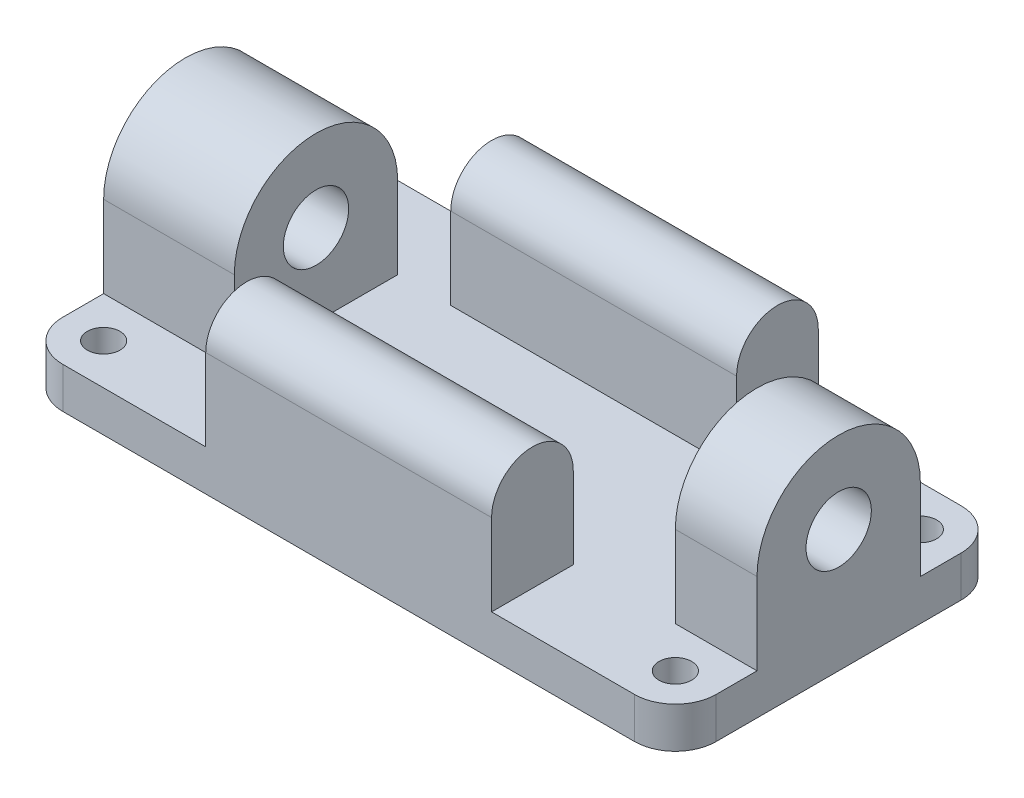
ISO-10303-21;
HEADER;
FILE_DESCRIPTION(('STEP AP214'),'2;1');
FILE_NAME('part.step','',(''),(''),'','','');
FILE_SCHEMA(('AUTOMOTIVE_DESIGN { 1 0 10303 214 1 1 1 1 }'));
ENDSEC;
DATA;
#1=APPLICATION_CONTEXT('core data for automotive mechanical design processes');
#2=APPLICATION_PROTOCOL_DEFINITION('international standard','automotive_design',2000,#1);
#3=PRODUCT_CONTEXT('',#1,'mechanical');
#4=PRODUCT('Part','Part','',(#3));
#5=PRODUCT_RELATED_PRODUCT_CATEGORY('part','',(#4));
#6=PRODUCT_DEFINITION_FORMATION('','',#4);
#7=PRODUCT_DEFINITION_CONTEXT('part definition',#1,'design');
#8=PRODUCT_DEFINITION('design','',#6,#7);
#9=PRODUCT_DEFINITION_SHAPE('','',#8);
#10=(LENGTH_UNIT() NAMED_UNIT(*) SI_UNIT(.MILLI.,.METRE.));
#11=(NAMED_UNIT(*) PLANE_ANGLE_UNIT() SI_UNIT($,.RADIAN.));
#12=(NAMED_UNIT(*) SI_UNIT($,.STERADIAN.) SOLID_ANGLE_UNIT());
#13=UNCERTAINTY_MEASURE_WITH_UNIT(LENGTH_MEASURE(1.E-05),#10,'distance_accuracy_value','');
#14=(GEOMETRIC_REPRESENTATION_CONTEXT(3) GLOBAL_UNCERTAINTY_ASSIGNED_CONTEXT((#13)) GLOBAL_UNIT_ASSIGNED_CONTEXT((#10,
#11,#12)) REPRESENTATION_CONTEXT('',''));
#15=CARTESIAN_POINT('',(0.,0.,0.));
#16=DIRECTION('',(0.,0.,1.));
#17=DIRECTION('',(1.,0.,0.));
#18=AXIS2_PLACEMENT_3D('',#15,#16,#17);
#19=CARTESIAN_POINT('',(-35.,5.,-15.));
#20=DIRECTION('',(0.,1.,0.));
#21=DIRECTION('',(0.,0.,1.));
#22=AXIS2_PLACEMENT_3D('',#19,#20,#21);
#23=PLANE('',#22);
#24=CARTESIAN_POINT('',(35.,5.,-15.));
#25=DIRECTION('',(0.,1.,0.));
#26=DIRECTION('',(0.,0.,-1.));
#27=AXIS2_PLACEMENT_3D('',#24,#25,#26);
#28=CIRCLE('',#27,1.99999999999999);
#29=CARTESIAN_POINT('',(35.,5.,-17.));
#30=VERTEX_POINT('',#29);
#31=EDGE_CURVE('E396',#30,#30,#28,.T.);
#32=ORIENTED_EDGE('',*,*,#31,.F.);
#33=EDGE_LOOP('',(#32));
#34=FACE_BOUND('',#33,.T.);
#35=CARTESIAN_POINT('',(-35.,5.,-15.));
#36=DIRECTION('',(0.,1.,0.));
#37=DIRECTION('',(0.,0.,1.));
#38=AXIS2_PLACEMENT_3D('',#35,#36,#37);
#39=CIRCLE('',#38,2.);
#40=CARTESIAN_POINT('',(-35.,5.,-13.));
#41=VERTEX_POINT('',#40);
#42=EDGE_CURVE('E412',#41,#41,#39,.T.);
#43=ORIENTED_EDGE('',*,*,#42,.F.);
#44=EDGE_LOOP('',(#43));
#45=FACE_BOUND('',#44,.T.);
#46=CARTESIAN_POINT('',(-35.,5.,15.));
#47=DIRECTION('',(0.,1.,0.));
#48=DIRECTION('',(0.,0.,-1.));
#49=AXIS2_PLACEMENT_3D('',#46,#47,#48);
#50=CIRCLE('',#49,1.99999999999999);
#51=CARTESIAN_POINT('',(-35.,5.,13.));
#52=VERTEX_POINT('',#51);
#53=EDGE_CURVE('E404',#52,#52,#50,.T.);
#54=ORIENTED_EDGE('',*,*,#53,.F.);
#55=EDGE_LOOP('',(#54));
#56=FACE_BOUND('',#55,.T.);
#57=CARTESIAN_POINT('',(35.,5.,15.));
#58=DIRECTION('',(0.,1.,0.));
#59=DIRECTION('',(0.,0.,1.));
#60=AXIS2_PLACEMENT_3D('',#57,#58,#59);
#61=CIRCLE('',#60,1.99999999999999);
#62=CARTESIAN_POINT('',(35.,5.,17.));
#63=VERTEX_POINT('',#62);
#64=EDGE_CURVE('E388',#63,#63,#61,.T.);
#65=ORIENTED_EDGE('',*,*,#64,.F.);
#66=EDGE_LOOP('',(#65));
#67=FACE_BOUND('',#66,.T.);
#68=DIRECTION('',(1.,0.,0.));
#69=VECTOR('',#68,1.);
#70=CARTESIAN_POINT('',(-35.,5.,20.));
#71=LINE('',#70,#69);
#72=CARTESIAN_POINT('',(-35.,5.,20.));
#73=VERTEX_POINT('',#72);
#74=CARTESIAN_POINT('',(-17.5,5.,20.));
#75=VERTEX_POINT('',#74);
#76=EDGE_CURVE('E433',#73,#75,#71,.T.);
#77=ORIENTED_EDGE('',*,*,#76,.T.);
#78=DIRECTION('',(0.,0.,1.));
#79=VECTOR('',#78,1.);
#80=CARTESIAN_POINT('',(-17.5,5.,20.));
#81=LINE('',#80,#79);
#82=CARTESIAN_POINT('',(-17.5,5.,10.));
#83=VERTEX_POINT('',#82);
#84=EDGE_CURVE('E68',#83,#75,#81,.T.);
#85=ORIENTED_EDGE('',*,*,#84,.F.);
#86=DIRECTION('',(-1.,0.,0.));
#87=VECTOR('',#86,1.);
#88=CARTESIAN_POINT('',(-17.5,5.,10.));
#89=LINE('',#88,#87);
#90=CARTESIAN_POINT('',(17.5,5.,10.));
#91=VERTEX_POINT('',#90);
#92=EDGE_CURVE('E63',#91,#83,#89,.T.);
#93=ORIENTED_EDGE('',*,*,#92,.F.);
#94=DIRECTION('',(0.,0.,-1.));
#95=VECTOR('',#94,1.);
#96=CARTESIAN_POINT('',(17.5,5.,20.));
#97=LINE('',#96,#95);
#98=CARTESIAN_POINT('',(17.5,5.,20.));
#99=VERTEX_POINT('',#98);
#100=EDGE_CURVE('E226',#99,#91,#97,.T.);
#101=ORIENTED_EDGE('',*,*,#100,.F.);
#102=CARTESIAN_POINT('',(35.,5.,20.));
#103=VERTEX_POINT('',#102);
#104=EDGE_CURVE('E432',#99,#103,#71,.T.);
#105=ORIENTED_EDGE('',*,*,#104,.T.);
#106=CARTESIAN_POINT('',(35.,5.,15.));
#107=DIRECTION('',(0.,1.,0.));
#108=DIRECTION('',(0.,0.,1.));
#109=AXIS2_PLACEMENT_3D('',#106,#107,#108);
#110=CIRCLE('',#109,5.);
#111=CARTESIAN_POINT('',(40.,5.,15.));
#112=VERTEX_POINT('',#111);
#113=EDGE_CURVE('E436',#103,#112,#110,.T.);
#114=ORIENTED_EDGE('',*,*,#113,.T.);
#115=DIRECTION('',(0.,0.,-1.));
#116=VECTOR('',#115,1.);
#117=CARTESIAN_POINT('',(40.,5.,-15.));
#118=LINE('',#117,#116);
#119=CARTESIAN_POINT('',(40.,5.,9.99999999999998));
#120=VERTEX_POINT('',#119);
#121=EDGE_CURVE('E440',#112,#120,#118,.T.);
#122=ORIENTED_EDGE('',*,*,#121,.T.);
#123=DIRECTION('',(1.,0.,0.));
#124=VECTOR('',#123,1.);
#125=CARTESIAN_POINT('',(-35.,5.,10.));
#126=LINE('',#125,#124);
#127=CARTESIAN_POINT('',(30.,5.,9.99999999999999));
#128=VERTEX_POINT('',#127);
#129=EDGE_CURVE('E373',#128,#120,#126,.T.);
#130=ORIENTED_EDGE('',*,*,#129,.F.);
#131=DIRECTION('',(0.,0.,-1.));
#132=VECTOR('',#131,1.);
#133=CARTESIAN_POINT('',(30.,5.,-15.));
#134=LINE('',#133,#132);
#135=CARTESIAN_POINT('',(30.,5.,-10.));
#136=VERTEX_POINT('',#135);
#137=EDGE_CURVE('E384',#128,#136,#134,.T.);
#138=ORIENTED_EDGE('',*,*,#137,.T.);
#139=DIRECTION('',(-1.,0.,0.));
#140=VECTOR('',#139,1.);
#141=CARTESIAN_POINT('',(-35.,5.,-9.99999999999998));
#142=LINE('',#141,#140);
#143=CARTESIAN_POINT('',(40.,5.,-10.));
#144=VERTEX_POINT('',#143);
#145=EDGE_CURVE('E380',#144,#136,#142,.T.);
#146=ORIENTED_EDGE('',*,*,#145,.F.);
#147=CARTESIAN_POINT('',(40.,5.,-15.));
#148=VERTEX_POINT('',#147);
#149=EDGE_CURVE('E439',#144,#148,#118,.T.);
#150=ORIENTED_EDGE('',*,*,#149,.T.);
#151=CARTESIAN_POINT('',(35.,5.,-15.));
#152=DIRECTION('',(0.,1.,0.));
#153=DIRECTION('',(0.,0.,1.));
#154=AXIS2_PLACEMENT_3D('',#151,#152,#153);
#155=CIRCLE('',#154,5.);
#156=CARTESIAN_POINT('',(35.,5.,-20.));
#157=VERTEX_POINT('',#156);
#158=EDGE_CURVE('E443',#148,#157,#155,.T.);
#159=ORIENTED_EDGE('',*,*,#158,.T.);
#160=DIRECTION('',(-1.,0.,0.));
#161=VECTOR('',#160,1.);
#162=CARTESIAN_POINT('',(-35.,5.,-20.));
#163=LINE('',#162,#161);
#164=CARTESIAN_POINT('',(17.5,5.,-20.));
#165=VERTEX_POINT('',#164);
#166=EDGE_CURVE('E447',#157,#165,#163,.T.);
#167=ORIENTED_EDGE('',*,*,#166,.T.);
#168=DIRECTION('',(0.,0.,-1.));
#169=VECTOR('',#168,1.);
#170=CARTESIAN_POINT('',(17.5,5.,-20.));
#171=LINE('',#170,#169);
#172=CARTESIAN_POINT('',(17.5,5.,-10.));
#173=VERTEX_POINT('',#172);
#174=EDGE_CURVE('E268',#173,#165,#171,.T.);
#175=ORIENTED_EDGE('',*,*,#174,.F.);
#176=DIRECTION('',(1.,0.,0.));
#177=VECTOR('',#176,1.);
#178=CARTESIAN_POINT('',(-17.5,5.,-10.));
#179=LINE('',#178,#177);
#180=CARTESIAN_POINT('',(-17.5,5.,-10.));
#181=VERTEX_POINT('',#180);
#182=EDGE_CURVE('E276',#181,#173,#179,.T.);
#183=ORIENTED_EDGE('',*,*,#182,.F.);
#184=DIRECTION('',(0.,0.,1.));
#185=VECTOR('',#184,1.);
#186=CARTESIAN_POINT('',(-17.5,5.,-20.));
#187=LINE('',#186,#185);
#188=CARTESIAN_POINT('',(-17.5,5.,-20.));
#189=VERTEX_POINT('',#188);
#190=EDGE_CURVE('E259',#189,#181,#187,.T.);
#191=ORIENTED_EDGE('',*,*,#190,.F.);
#192=CARTESIAN_POINT('',(-35.,5.,-20.));
#193=VERTEX_POINT('',#192);
#194=EDGE_CURVE('E446',#189,#193,#163,.T.);
#195=ORIENTED_EDGE('',*,*,#194,.T.);
#196=CARTESIAN_POINT('',(-35.,5.,-15.));
#197=DIRECTION('',(0.,1.,0.));
#198=DIRECTION('',(0.,0.,1.));
#199=AXIS2_PLACEMENT_3D('',#196,#197,#198);
#200=CIRCLE('',#199,5.);
#201=CARTESIAN_POINT('',(-40.,5.,-15.));
#202=VERTEX_POINT('',#201);
#203=EDGE_CURVE('E420',#193,#202,#200,.T.);
#204=ORIENTED_EDGE('',*,*,#203,.T.);
#205=DIRECTION('',(0.,0.,1.));
#206=VECTOR('',#205,1.);
#207=CARTESIAN_POINT('',(-40.,5.,-15.));
#208=LINE('',#207,#206);
#209=CARTESIAN_POINT('',(-40.,5.,-10.));
#210=VERTEX_POINT('',#209);
#211=EDGE_CURVE('E426',#202,#210,#208,.T.);
#212=ORIENTED_EDGE('',*,*,#211,.T.);
#213=DIRECTION('',(-1.,0.,0.));
#214=VECTOR('',#213,1.);
#215=CARTESIAN_POINT('',(-35.,5.,-10.));
#216=LINE('',#215,#214);
#217=CARTESIAN_POINT('',(-24.,5.,-10.));
#218=VERTEX_POINT('',#217);
#219=EDGE_CURVE('E335',#218,#210,#216,.T.);
#220=ORIENTED_EDGE('',*,*,#219,.F.);
#221=DIRECTION('',(0.,0.,1.));
#222=VECTOR('',#221,1.);
#223=CARTESIAN_POINT('',(-24.,5.,-15.));
#224=LINE('',#223,#222);
#225=CARTESIAN_POINT('',(-24.,5.,10.));
#226=VERTEX_POINT('',#225);
#227=EDGE_CURVE('E339',#218,#226,#224,.T.);
#228=ORIENTED_EDGE('',*,*,#227,.T.);
#229=DIRECTION('',(1.,0.,0.));
#230=VECTOR('',#229,1.);
#231=CARTESIAN_POINT('',(-35.,5.,10.));
#232=LINE('',#231,#230);
#233=CARTESIAN_POINT('',(-40.,5.,10.));
#234=VERTEX_POINT('',#233);
#235=EDGE_CURVE('E328',#234,#226,#232,.T.);
#236=ORIENTED_EDGE('',*,*,#235,.F.);
#237=CARTESIAN_POINT('',(-40.,5.,15.));
#238=VERTEX_POINT('',#237);
#239=EDGE_CURVE('E424',#234,#238,#208,.T.);
#240=ORIENTED_EDGE('',*,*,#239,.T.);
#241=CARTESIAN_POINT('',(-35.,5.,15.));
#242=DIRECTION('',(0.,1.,0.));
#243=DIRECTION('',(0.,0.,-1.));
#244=AXIS2_PLACEMENT_3D('',#241,#242,#243);
#245=CIRCLE('',#244,5.);
#246=EDGE_CURVE('E429',#238,#73,#245,.T.);
#247=ORIENTED_EDGE('',*,*,#246,.T.);
#248=EDGE_LOOP('',(#77,#85,#93,#101,#105,#114,#122,#130,#138,#146,#150,#159,#167,#175,#183,#191,
#195,#204,#212,#220,#228,#236,#240,#247));
#249=FACE_BOUND('',#248,.T.);
#250=ADVANCED_FACE('F45',(#34,#45,#56,#67,#249),#23,.T.);
#251=CARTESIAN_POINT('',(-35.,0.,-15.));
#252=DIRECTION('',(0.,1.,0.));
#253=DIRECTION('',(0.,0.,1.));
#254=AXIS2_PLACEMENT_3D('',#251,#252,#253);
#255=PLANE('',#254);
#256=CARTESIAN_POINT('',(-35.,0.,15.));
#257=DIRECTION('',(0.,1.,0.));
#258=DIRECTION('',(0.,0.,-1.));
#259=AXIS2_PLACEMENT_3D('',#256,#257,#258);
#260=CIRCLE('',#259,5.);
#261=CARTESIAN_POINT('',(-40.,0.,15.));
#262=VERTEX_POINT('',#261);
#263=CARTESIAN_POINT('',(-35.,0.,20.));
#264=VERTEX_POINT('',#263);
#265=EDGE_CURVE('E457',#262,#264,#260,.T.);
#266=ORIENTED_EDGE('',*,*,#265,.F.);
#267=DIRECTION('',(0.,0.,1.));
#268=VECTOR('',#267,1.);
#269=CARTESIAN_POINT('',(-40.,0.,-15.));
#270=LINE('',#269,#268);
#271=CARTESIAN_POINT('',(-40.,0.,-15.));
#272=VERTEX_POINT('',#271);
#273=EDGE_CURVE('E454',#272,#262,#270,.T.);
#274=ORIENTED_EDGE('',*,*,#273,.F.);
#275=CARTESIAN_POINT('',(-35.,0.,-15.));
#276=DIRECTION('',(0.,1.,0.));
#277=DIRECTION('',(0.,0.,1.));
#278=AXIS2_PLACEMENT_3D('',#275,#276,#277);
#279=CIRCLE('',#278,5.);
#280=CARTESIAN_POINT('',(-35.,0.,-20.));
#281=VERTEX_POINT('',#280);
#282=EDGE_CURVE('E416',#281,#272,#279,.T.);
#283=ORIENTED_EDGE('',*,*,#282,.F.);
#284=DIRECTION('',(-1.,0.,0.));
#285=VECTOR('',#284,1.);
#286=CARTESIAN_POINT('',(-35.,0.,-20.));
#287=LINE('',#286,#285);
#288=CARTESIAN_POINT('',(35.,0.,-20.));
#289=VERTEX_POINT('',#288);
#290=EDGE_CURVE('E425',#289,#281,#287,.T.);
#291=ORIENTED_EDGE('',*,*,#290,.F.);
#292=CARTESIAN_POINT('',(35.,0.,-15.));
#293=DIRECTION('',(0.,1.,0.));
#294=DIRECTION('',(0.,0.,1.));
#295=AXIS2_PLACEMENT_3D('',#292,#293,#294);
#296=CIRCLE('',#295,5.);
#297=CARTESIAN_POINT('',(40.,0.,-15.));
#298=VERTEX_POINT('',#297);
#299=EDGE_CURVE('E469',#298,#289,#296,.T.);
#300=ORIENTED_EDGE('',*,*,#299,.F.);
#301=DIRECTION('',(0.,0.,-1.));
#302=VECTOR('',#301,1.);
#303=CARTESIAN_POINT('',(40.,0.,-15.));
#304=LINE('',#303,#302);
#305=CARTESIAN_POINT('',(40.,0.,15.));
#306=VERTEX_POINT('',#305);
#307=EDGE_CURVE('E466',#306,#298,#304,.T.);
#308=ORIENTED_EDGE('',*,*,#307,.F.);
#309=CARTESIAN_POINT('',(35.,0.,15.));
#310=DIRECTION('',(0.,1.,0.));
#311=DIRECTION('',(0.,0.,1.));
#312=AXIS2_PLACEMENT_3D('',#309,#310,#311);
#313=CIRCLE('',#312,5.);
#314=CARTESIAN_POINT('',(35.,0.,20.));
#315=VERTEX_POINT('',#314);
#316=EDGE_CURVE('E463',#315,#306,#313,.T.);
#317=ORIENTED_EDGE('',*,*,#316,.F.);
#318=DIRECTION('',(1.,0.,0.));
#319=VECTOR('',#318,1.);
#320=CARTESIAN_POINT('',(-35.,0.,20.));
#321=LINE('',#320,#319);
#322=EDGE_CURVE('E460',#264,#315,#321,.T.);
#323=ORIENTED_EDGE('',*,*,#322,.F.);
#324=EDGE_LOOP('',(#266,#274,#283,#291,#300,#308,#317,#323));
#325=FACE_BOUND('',#324,.T.);
#326=CARTESIAN_POINT('',(-35.,0.,-15.));
#327=DIRECTION('',(0.,1.,0.));
#328=DIRECTION('',(0.,0.,1.));
#329=AXIS2_PLACEMENT_3D('',#326,#327,#328);
#330=CIRCLE('',#329,2.);
#331=CARTESIAN_POINT('',(-35.,0.,-13.));
#332=VERTEX_POINT('',#331);
#333=EDGE_CURVE('E408',#332,#332,#330,.T.);
#334=ORIENTED_EDGE('',*,*,#333,.T.);
#335=EDGE_LOOP('',(#334));
#336=FACE_BOUND('',#335,.T.);
#337=CARTESIAN_POINT('',(-35.,0.,15.));
#338=DIRECTION('',(0.,1.,0.));
#339=DIRECTION('',(0.,0.,-1.));
#340=AXIS2_PLACEMENT_3D('',#337,#338,#339);
#341=CIRCLE('',#340,1.99999999999999);
#342=CARTESIAN_POINT('',(-35.,0.,13.));
#343=VERTEX_POINT('',#342);
#344=EDGE_CURVE('E400',#343,#343,#341,.T.);
#345=ORIENTED_EDGE('',*,*,#344,.T.);
#346=EDGE_LOOP('',(#345));
#347=FACE_BOUND('',#346,.T.);
#348=CARTESIAN_POINT('',(35.,0.,-15.));
#349=DIRECTION('',(0.,1.,0.));
#350=DIRECTION('',(0.,0.,-1.));
#351=AXIS2_PLACEMENT_3D('',#348,#349,#350);
#352=CIRCLE('',#351,1.99999999999999);
#353=CARTESIAN_POINT('',(35.,0.,-17.));
#354=VERTEX_POINT('',#353);
#355=EDGE_CURVE('E392',#354,#354,#352,.T.);
#356=ORIENTED_EDGE('',*,*,#355,.T.);
#357=EDGE_LOOP('',(#356));
#358=FACE_BOUND('',#357,.T.);
#359=CARTESIAN_POINT('',(35.,0.,15.));
#360=DIRECTION('',(0.,1.,0.));
#361=DIRECTION('',(0.,0.,1.));
#362=AXIS2_PLACEMENT_3D('',#359,#360,#361);
#363=CIRCLE('',#362,1.99999999999999);
#364=CARTESIAN_POINT('',(35.,0.,17.));
#365=VERTEX_POINT('',#364);
#366=EDGE_CURVE('E387',#365,#365,#363,.T.);
#367=ORIENTED_EDGE('',*,*,#366,.T.);
#368=EDGE_LOOP('',(#367));
#369=FACE_BOUND('',#368,.T.);
#370=ADVANCED_FACE('F522',(#325,#336,#347,#358,#369),#255,.F.);
#371=CARTESIAN_POINT('',(-35.,5.,-15.));
#372=DIRECTION('',(0.,-1.,0.));
#373=DIRECTION('',(0.,0.,-1.));
#374=AXIS2_PLACEMENT_3D('',#371,#372,#373);
#375=CYLINDRICAL_SURFACE('',#374,5.);
#376=ORIENTED_EDGE('',*,*,#282,.T.);
#377=DIRECTION('',(0.,-1.,0.));
#378=VECTOR('',#377,1.);
#379=CARTESIAN_POINT('',(-40.,5.,-15.));
#380=LINE('',#379,#378);
#381=EDGE_CURVE('E11',#202,#272,#380,.T.);
#382=ORIENTED_EDGE('',*,*,#381,.F.);
#383=ORIENTED_EDGE('',*,*,#203,.F.);
#384=DIRECTION('',(0.,-1.,0.));
#385=VECTOR('',#384,1.);
#386=CARTESIAN_POINT('',(-35.,5.,-20.));
#387=LINE('',#386,#385);
#388=EDGE_CURVE('E450',#193,#281,#387,.T.);
#389=ORIENTED_EDGE('',*,*,#388,.T.);
#390=EDGE_LOOP('',(#376,#382,#383,#389));
#391=FACE_BOUND('',#390,.T.);
#392=ADVANCED_FACE('F47',(#391),#375,.T.);
#393=CARTESIAN_POINT('',(-40.,5.,-15.));
#394=DIRECTION('',(1.,0.,0.));
#395=DIRECTION('',(0.,0.,-1.));
#396=AXIS2_PLACEMENT_3D('',#393,#394,#395);
#397=PLANE('',#396);
#398=CARTESIAN_POINT('',(-40.,15.,0.));
#399=DIRECTION('',(-1.,0.,0.));
#400=DIRECTION('',(0.,0.,1.));
#401=AXIS2_PLACEMENT_3D('',#398,#399,#400);
#402=CIRCLE('',#401,4.);
#403=CARTESIAN_POINT('',(-40.,15.,4.));
#404=VERTEX_POINT('',#403);
#405=EDGE_CURVE('E298',#404,#404,#402,.T.);
#406=ORIENTED_EDGE('',*,*,#405,.F.);
#407=EDGE_LOOP('',(#406));
#408=FACE_BOUND('',#407,.T.);
#409=ORIENTED_EDGE('',*,*,#239,.F.);
#410=DIRECTION('',(0.,1.,0.));
#411=VECTOR('',#410,1.);
#412=CARTESIAN_POINT('',(-40.,15.,10.));
#413=LINE('',#412,#411);
#414=CARTESIAN_POINT('',(-40.,15.,10.));
#415=VERTEX_POINT('',#414);
#416=EDGE_CURVE('E315',#234,#415,#413,.T.);
#417=ORIENTED_EDGE('',*,*,#416,.T.);
#418=CARTESIAN_POINT('',(-40.,15.,0.));
#419=DIRECTION('',(-1.,0.,0.));
#420=DIRECTION('',(0.,0.,1.));
#421=AXIS2_PLACEMENT_3D('',#418,#419,#420);
#422=CIRCLE('',#421,10.);
#423=CARTESIAN_POINT('',(-40.,15.,-10.));
#424=VERTEX_POINT('',#423);
#425=EDGE_CURVE('E318',#415,#424,#422,.T.);
#426=ORIENTED_EDGE('',*,*,#425,.T.);
#427=DIRECTION('',(0.,-1.,0.));
#428=VECTOR('',#427,1.);
#429=CARTESIAN_POINT('',(-40.,0.,-10.));
#430=LINE('',#429,#428);
#431=EDGE_CURVE('E306',#424,#210,#430,.T.);
#432=ORIENTED_EDGE('',*,*,#431,.T.);
#433=ORIENTED_EDGE('',*,*,#211,.F.);
#434=ORIENTED_EDGE('',*,*,#381,.T.);
#435=ORIENTED_EDGE('',*,*,#273,.T.);
#436=DIRECTION('',(0.,-1.,0.));
#437=VECTOR('',#436,1.);
#438=CARTESIAN_POINT('',(-40.,5.,15.));
#439=LINE('',#438,#437);
#440=EDGE_CURVE('E55',#238,#262,#439,.T.);
#441=ORIENTED_EDGE('',*,*,#440,.F.);
#442=EDGE_LOOP('',(#409,#417,#426,#432,#433,#434,#435,#441));
#443=FACE_BOUND('',#442,.T.);
#444=ADVANCED_FACE('F558',(#408,#443),#397,.F.);
#445=CARTESIAN_POINT('',(-35.,5.,15.));
#446=DIRECTION('',(0.,-1.,0.));
#447=DIRECTION('',(0.,0.,-1.));
#448=AXIS2_PLACEMENT_3D('',#445,#446,#447);
#449=CYLINDRICAL_SURFACE('',#448,5.);
#450=ORIENTED_EDGE('',*,*,#265,.T.);
#451=DIRECTION('',(0.,-1.,0.));
#452=VECTOR('',#451,1.);
#453=CARTESIAN_POINT('',(-35.,5.,20.));
#454=LINE('',#453,#452);
#455=EDGE_CURVE('E493',#73,#264,#454,.T.);
#456=ORIENTED_EDGE('',*,*,#455,.F.);
#457=ORIENTED_EDGE('',*,*,#246,.F.);
#458=ORIENTED_EDGE('',*,*,#440,.T.);
#459=EDGE_LOOP('',(#450,#456,#457,#458));
#460=FACE_BOUND('',#459,.T.);
#461=ADVANCED_FACE('F555',(#460),#449,.T.);
#462=CARTESIAN_POINT('',(-35.,5.,20.));
#463=DIRECTION('',(0.,0.,-1.));
#464=DIRECTION('',(-1.,0.,0.));
#465=AXIS2_PLACEMENT_3D('',#462,#463,#464);
#466=PLANE('',#465);
#467=ORIENTED_EDGE('',*,*,#322,.T.);
#468=DIRECTION('',(0.,-1.,0.));
#469=VECTOR('',#468,1.);
#470=CARTESIAN_POINT('',(35.,5.,20.));
#471=LINE('',#470,#469);
#472=EDGE_CURVE('E489',#103,#315,#471,.T.);
#473=ORIENTED_EDGE('',*,*,#472,.F.);
#474=ORIENTED_EDGE('',*,*,#104,.F.);
#475=DIRECTION('',(0.,-1.,0.));
#476=VECTOR('',#475,1.);
#477=CARTESIAN_POINT('',(17.5,15.,20.));
#478=LINE('',#477,#476);
#479=CARTESIAN_POINT('',(17.5,15.,20.));
#480=VERTEX_POINT('',#479);
#481=EDGE_CURVE('E228',#480,#99,#478,.T.);
#482=ORIENTED_EDGE('',*,*,#481,.F.);
#483=DIRECTION('',(1.,0.,0.));
#484=VECTOR('',#483,1.);
#485=CARTESIAN_POINT('',(-17.5,15.,20.));
#486=LINE('',#485,#484);
#487=CARTESIAN_POINT('',(-17.5,15.,20.));
#488=VERTEX_POINT('',#487);
#489=EDGE_CURVE('E219',#488,#480,#486,.T.);
#490=ORIENTED_EDGE('',*,*,#489,.F.);
#491=DIRECTION('',(0.,-1.,0.));
#492=VECTOR('',#491,1.);
#493=CARTESIAN_POINT('',(-17.5,15.,20.));
#494=LINE('',#493,#492);
#495=EDGE_CURVE('E250',#488,#75,#494,.T.);
#496=ORIENTED_EDGE('',*,*,#495,.T.);
#497=ORIENTED_EDGE('',*,*,#76,.F.);
#498=ORIENTED_EDGE('',*,*,#455,.T.);
#499=EDGE_LOOP('',(#467,#473,#474,#482,#490,#496,#497,#498));
#500=FACE_BOUND('',#499,.T.);
#501=ADVANCED_FACE('F551',(#500),#466,.F.);
#502=CARTESIAN_POINT('',(35.,5.,15.));
#503=DIRECTION('',(0.,-1.,0.));
#504=DIRECTION('',(0.,0.,-1.));
#505=AXIS2_PLACEMENT_3D('',#502,#503,#504);
#506=CYLINDRICAL_SURFACE('',#505,5.);
#507=ORIENTED_EDGE('',*,*,#316,.T.);
#508=DIRECTION('',(0.,-1.,0.));
#509=VECTOR('',#508,1.);
#510=CARTESIAN_POINT('',(40.,5.,15.));
#511=LINE('',#510,#509);
#512=EDGE_CURVE('E485',#112,#306,#511,.T.);
#513=ORIENTED_EDGE('',*,*,#512,.F.);
#514=ORIENTED_EDGE('',*,*,#113,.F.);
#515=ORIENTED_EDGE('',*,*,#472,.T.);
#516=EDGE_LOOP('',(#507,#513,#514,#515));
#517=FACE_BOUND('',#516,.T.);
#518=ADVANCED_FACE('F547',(#517),#506,.T.);
#519=CARTESIAN_POINT('',(40.,5.,-15.));
#520=DIRECTION('',(-1.,0.,0.));
#521=DIRECTION('',(0.,0.,1.));
#522=AXIS2_PLACEMENT_3D('',#519,#520,#521);
#523=PLANE('',#522);
#524=CARTESIAN_POINT('',(40.,15.,0.));
#525=DIRECTION('',(1.,0.,0.));
#526=DIRECTION('',(0.,0.,-1.));
#527=AXIS2_PLACEMENT_3D('',#524,#525,#526);
#528=CIRCLE('',#527,4.);
#529=CARTESIAN_POINT('',(40.,15.,-4.00000000000002));
#530=VERTEX_POINT('',#529);
#531=EDGE_CURVE('E342',#530,#530,#528,.T.);
#532=ORIENTED_EDGE('',*,*,#531,.F.);
#533=EDGE_LOOP('',(#532));
#534=FACE_BOUND('',#533,.T.);
#535=ORIENTED_EDGE('',*,*,#307,.T.);
#536=DIRECTION('',(0.,-1.,0.));
#537=VECTOR('',#536,1.);
#538=CARTESIAN_POINT('',(40.,5.,-15.));
#539=LINE('',#538,#537);
#540=EDGE_CURVE('E481',#148,#298,#539,.T.);
#541=ORIENTED_EDGE('',*,*,#540,.F.);
#542=ORIENTED_EDGE('',*,*,#149,.F.);
#543=DIRECTION('',(0.,1.,0.));
#544=VECTOR('',#543,1.);
#545=CARTESIAN_POINT('',(40.,0.,-10.));
#546=LINE('',#545,#544);
#547=CARTESIAN_POINT('',(40.,15.,-10.));
#548=VERTEX_POINT('',#547);
#549=EDGE_CURVE('E360',#144,#548,#546,.T.);
#550=ORIENTED_EDGE('',*,*,#549,.T.);
#551=CARTESIAN_POINT('',(40.,15.,0.));
#552=DIRECTION('',(1.,0.,0.));
#553=DIRECTION('',(0.,0.,-1.));
#554=AXIS2_PLACEMENT_3D('',#551,#552,#553);
#555=CIRCLE('',#554,10.);
#556=CARTESIAN_POINT('',(40.,15.,9.99999999999998));
#557=VERTEX_POINT('',#556);
#558=EDGE_CURVE('E363',#548,#557,#555,.T.);
#559=ORIENTED_EDGE('',*,*,#558,.T.);
#560=DIRECTION('',(0.,-1.,0.));
#561=VECTOR('',#560,1.);
#562=CARTESIAN_POINT('',(40.,0.,9.99999999999998));
#563=LINE('',#562,#561);
#564=EDGE_CURVE('E351',#557,#120,#563,.T.);
#565=ORIENTED_EDGE('',*,*,#564,.T.);
#566=ORIENTED_EDGE('',*,*,#121,.F.);
#567=ORIENTED_EDGE('',*,*,#512,.T.);
#568=EDGE_LOOP('',(#535,#541,#542,#550,#559,#565,#566,#567));
#569=FACE_BOUND('',#568,.T.);
#570=ADVANCED_FACE('F543',(#534,#569),#523,.F.);
#571=CARTESIAN_POINT('',(35.,5.,-15.));
#572=DIRECTION('',(0.,-1.,0.));
#573=DIRECTION('',(0.,0.,-1.));
#574=AXIS2_PLACEMENT_3D('',#571,#572,#573);
#575=CYLINDRICAL_SURFACE('',#574,5.);
#576=ORIENTED_EDGE('',*,*,#299,.T.);
#577=DIRECTION('',(0.,-1.,0.));
#578=VECTOR('',#577,1.);
#579=CARTESIAN_POINT('',(35.,5.,-20.));
#580=LINE('',#579,#578);
#581=EDGE_CURVE('E477',#157,#289,#580,.T.);
#582=ORIENTED_EDGE('',*,*,#581,.F.);
#583=ORIENTED_EDGE('',*,*,#158,.F.);
#584=ORIENTED_EDGE('',*,*,#540,.T.);
#585=EDGE_LOOP('',(#576,#582,#583,#584));
#586=FACE_BOUND('',#585,.T.);
#587=ADVANCED_FACE('F539',(#586),#575,.T.);
#588=CARTESIAN_POINT('',(-35.,5.,-20.));
#589=DIRECTION('',(0.,0.,1.));
#590=DIRECTION('',(1.,0.,0.));
#591=AXIS2_PLACEMENT_3D('',#588,#589,#590);
#592=PLANE('',#591);
#593=ORIENTED_EDGE('',*,*,#290,.T.);
#594=ORIENTED_EDGE('',*,*,#388,.F.);
#595=ORIENTED_EDGE('',*,*,#194,.F.);
#596=DIRECTION('',(0.,-1.,0.));
#597=VECTOR('',#596,1.);
#598=CARTESIAN_POINT('',(-17.5,15.,-20.));
#599=LINE('',#598,#597);
#600=CARTESIAN_POINT('',(-17.5,15.,-20.));
#601=VERTEX_POINT('',#600);
#602=EDGE_CURVE('E272',#601,#189,#599,.T.);
#603=ORIENTED_EDGE('',*,*,#602,.F.);
#604=DIRECTION('',(-1.,0.,0.));
#605=VECTOR('',#604,1.);
#606=CARTESIAN_POINT('',(-17.5,15.,-20.));
#607=LINE('',#606,#605);
#608=CARTESIAN_POINT('',(17.5,15.,-20.));
#609=VERTEX_POINT('',#608);
#610=EDGE_CURVE('E267',#609,#601,#607,.T.);
#611=ORIENTED_EDGE('',*,*,#610,.F.);
#612=DIRECTION('',(0.,-1.,0.));
#613=VECTOR('',#612,1.);
#614=CARTESIAN_POINT('',(17.5,15.,-20.));
#615=LINE('',#614,#613);
#616=EDGE_CURVE('E286',#609,#165,#615,.T.);
#617=ORIENTED_EDGE('',*,*,#616,.T.);
#618=ORIENTED_EDGE('',*,*,#166,.F.);
#619=ORIENTED_EDGE('',*,*,#581,.T.);
#620=EDGE_LOOP('',(#593,#594,#595,#603,#611,#617,#618,#619));
#621=FACE_BOUND('',#620,.T.);
#622=ADVANCED_FACE('F536',(#621),#592,.F.);
#623=CARTESIAN_POINT('',(-35.,5.,-15.));
#624=DIRECTION('',(0.,-1.,0.));
#625=DIRECTION('',(0.,0.,-1.));
#626=AXIS2_PLACEMENT_3D('',#623,#624,#625);
#627=CYLINDRICAL_SURFACE('',#626,2.);
#628=ORIENTED_EDGE('',*,*,#42,.T.);
#629=EDGE_LOOP('',(#628));
#630=FACE_BOUND('',#629,.T.);
#631=ORIENTED_EDGE('',*,*,#333,.F.);
#632=EDGE_LOOP('',(#631));
#633=FACE_BOUND('',#632,.T.);
#634=ADVANCED_FACE('F533',(#630,#633),#627,.F.);
#635=CARTESIAN_POINT('',(-35.,5.,15.));
#636=DIRECTION('',(0.,-1.,0.));
#637=DIRECTION('',(0.,0.,-1.));
#638=AXIS2_PLACEMENT_3D('',#635,#636,#637);
#639=CYLINDRICAL_SURFACE('',#638,1.99999999999999);
#640=ORIENTED_EDGE('',*,*,#53,.T.);
#641=EDGE_LOOP('',(#640));
#642=FACE_BOUND('',#641,.T.);
#643=ORIENTED_EDGE('',*,*,#344,.F.);
#644=EDGE_LOOP('',(#643));
#645=FACE_BOUND('',#644,.T.);
#646=ADVANCED_FACE('F778',(#642,#645),#639,.F.);
#647=CARTESIAN_POINT('',(35.,5.,-15.));
#648=DIRECTION('',(0.,-1.,0.));
#649=DIRECTION('',(0.,0.,-1.));
#650=AXIS2_PLACEMENT_3D('',#647,#648,#649);
#651=CYLINDRICAL_SURFACE('',#650,1.99999999999999);
#652=ORIENTED_EDGE('',*,*,#31,.T.);
#653=EDGE_LOOP('',(#652));
#654=FACE_BOUND('',#653,.T.);
#655=ORIENTED_EDGE('',*,*,#355,.F.);
#656=EDGE_LOOP('',(#655));
#657=FACE_BOUND('',#656,.T.);
#658=ADVANCED_FACE('F772',(#654,#657),#651,.F.);
#659=CARTESIAN_POINT('',(35.,5.,15.));
#660=DIRECTION('',(0.,-1.,0.));
#661=DIRECTION('',(0.,0.,-1.));
#662=AXIS2_PLACEMENT_3D('',#659,#660,#661);
#663=CYLINDRICAL_SURFACE('',#662,1.99999999999999);
#664=ORIENTED_EDGE('',*,*,#64,.T.);
#665=EDGE_LOOP('',(#664));
#666=FACE_BOUND('',#665,.T.);
#667=ORIENTED_EDGE('',*,*,#366,.F.);
#668=EDGE_LOOP('',(#667));
#669=FACE_BOUND('',#668,.T.);
#670=ADVANCED_FACE('F765',(#666,#669),#663,.F.);
#671=CARTESIAN_POINT('',(30.,0.,-10.));
#672=DIRECTION('',(0.,0.,-1.));
#673=DIRECTION('',(-1.,0.,0.));
#674=AXIS2_PLACEMENT_3D('',#671,#672,#673);
#675=PLANE('',#674);
#676=ORIENTED_EDGE('',*,*,#549,.F.);
#677=ORIENTED_EDGE('',*,*,#145,.T.);
#678=DIRECTION('',(0.,1.,0.));
#679=VECTOR('',#678,1.);
#680=CARTESIAN_POINT('',(30.,0.,-10.));
#681=LINE('',#680,#679);
#682=CARTESIAN_POINT('',(30.,15.,-10.));
#683=VERTEX_POINT('',#682);
#684=EDGE_CURVE('E347',#136,#683,#681,.T.);
#685=ORIENTED_EDGE('',*,*,#684,.T.);
#686=DIRECTION('',(1.,0.,0.));
#687=VECTOR('',#686,1.);
#688=CARTESIAN_POINT('',(30.,15.,-10.));
#689=LINE('',#688,#687);
#690=EDGE_CURVE('E359',#683,#548,#689,.T.);
#691=ORIENTED_EDGE('',*,*,#690,.T.);
#692=EDGE_LOOP('',(#676,#677,#685,#691));
#693=FACE_BOUND('',#692,.T.);
#694=ADVANCED_FACE('F763',(#693),#675,.T.);
#695=CARTESIAN_POINT('',(30.,0.,9.99999999999999));
#696=DIRECTION('',(0.,0.,1.));
#697=DIRECTION('',(1.,0.,0.));
#698=AXIS2_PLACEMENT_3D('',#695,#696,#697);
#699=PLANE('',#698);
#700=DIRECTION('',(0.,-1.,0.));
#701=VECTOR('',#700,1.);
#702=CARTESIAN_POINT('',(30.,0.,9.99999999999999));
#703=LINE('',#702,#701);
#704=CARTESIAN_POINT('',(30.,15.,9.99999999999999));
#705=VERTEX_POINT('',#704);
#706=EDGE_CURVE('E355',#705,#128,#703,.T.);
#707=ORIENTED_EDGE('',*,*,#706,.T.);
#708=ORIENTED_EDGE('',*,*,#129,.T.);
#709=ORIENTED_EDGE('',*,*,#564,.F.);
#710=DIRECTION('',(1.,0.,0.));
#711=VECTOR('',#710,1.);
#712=CARTESIAN_POINT('',(30.,15.,9.99999999999999));
#713=LINE('',#712,#711);
#714=EDGE_CURVE('E370',#705,#557,#713,.T.);
#715=ORIENTED_EDGE('',*,*,#714,.F.);
#716=EDGE_LOOP('',(#707,#708,#709,#715));
#717=FACE_BOUND('',#716,.T.);
#718=ADVANCED_FACE('F753',(#717),#699,.T.);
#719=CARTESIAN_POINT('',(30.,15.,0.));
#720=DIRECTION('',(1.,0.,0.));
#721=DIRECTION('',(0.,0.,-1.));
#722=AXIS2_PLACEMENT_3D('',#719,#720,#721);
#723=CYLINDRICAL_SURFACE('',#722,10.);
#724=ORIENTED_EDGE('',*,*,#558,.F.);
#725=ORIENTED_EDGE('',*,*,#690,.F.);
#726=CARTESIAN_POINT('',(30.,15.,0.));
#727=DIRECTION('',(1.,0.,0.));
#728=DIRECTION('',(0.,0.,-1.));
#729=AXIS2_PLACEMENT_3D('',#726,#727,#728);
#730=CIRCLE('',#729,10.);
#731=EDGE_CURVE('E350',#683,#705,#730,.T.);
#732=ORIENTED_EDGE('',*,*,#731,.T.);
#733=ORIENTED_EDGE('',*,*,#714,.T.);
#734=EDGE_LOOP('',(#724,#725,#732,#733));
#735=FACE_BOUND('',#734,.T.);
#736=ADVANCED_FACE('F518',(#735),#723,.T.);
#737=CARTESIAN_POINT('',(30.,0.,0.));
#738=DIRECTION('',(1.,0.,0.));
#739=DIRECTION('',(0.,0.,-1.));
#740=AXIS2_PLACEMENT_3D('',#737,#738,#739);
#741=PLANE('',#740);
#742=CARTESIAN_POINT('',(30.,15.,0.));
#743=DIRECTION('',(1.,0.,0.));
#744=DIRECTION('',(0.,0.,-1.));
#745=AXIS2_PLACEMENT_3D('',#742,#743,#744);
#746=CIRCLE('',#745,4.);
#747=CARTESIAN_POINT('',(30.,15.,-4.00000000000001));
#748=VERTEX_POINT('',#747);
#749=EDGE_CURVE('E346',#748,#748,#746,.T.);
#750=ORIENTED_EDGE('',*,*,#749,.T.);
#751=EDGE_LOOP('',(#750));
#752=FACE_BOUND('',#751,.T.);
#753=ORIENTED_EDGE('',*,*,#137,.F.);
#754=ORIENTED_EDGE('',*,*,#706,.F.);
#755=ORIENTED_EDGE('',*,*,#731,.F.);
#756=ORIENTED_EDGE('',*,*,#684,.F.);
#757=EDGE_LOOP('',(#753,#754,#755,#756));
#758=FACE_BOUND('',#757,.T.);
#759=ADVANCED_FACE('F503',(#752,#758),#741,.F.);
#760=CARTESIAN_POINT('',(24.,15.,0.));
#761=DIRECTION('',(1.,0.,0.));
#762=DIRECTION('',(0.,0.,-1.));
#763=AXIS2_PLACEMENT_3D('',#760,#761,#762);
#764=CYLINDRICAL_SURFACE('',#763,4.);
#765=ORIENTED_EDGE('',*,*,#531,.T.);
#766=EDGE_LOOP('',(#765));
#767=FACE_BOUND('',#766,.T.);
#768=ORIENTED_EDGE('',*,*,#749,.F.);
#769=EDGE_LOOP('',(#768));
#770=FACE_BOUND('',#769,.T.);
#771=ADVANCED_FACE('F506',(#767,#770),#764,.F.);
#772=CARTESIAN_POINT('',(-24.,0.,-10.));
#773=DIRECTION('',(0.,0.,-1.));
#774=DIRECTION('',(-1.,0.,0.));
#775=AXIS2_PLACEMENT_3D('',#772,#773,#774);
#776=PLANE('',#775);
#777=DIRECTION('',(0.,-1.,0.));
#778=VECTOR('',#777,1.);
#779=CARTESIAN_POINT('',(-24.,0.,-10.));
#780=LINE('',#779,#778);
#781=CARTESIAN_POINT('',(-24.,15.,-10.));
#782=VERTEX_POINT('',#781);
#783=EDGE_CURVE('E310',#782,#218,#780,.T.);
#784=ORIENTED_EDGE('',*,*,#783,.T.);
#785=ORIENTED_EDGE('',*,*,#219,.T.);
#786=ORIENTED_EDGE('',*,*,#431,.F.);
#787=DIRECTION('',(-1.,0.,0.));
#788=VECTOR('',#787,1.);
#789=CARTESIAN_POINT('',(-24.,15.,-10.));
#790=LINE('',#789,#788);
#791=EDGE_CURVE('E325',#782,#424,#790,.T.);
#792=ORIENTED_EDGE('',*,*,#791,.F.);
#793=EDGE_LOOP('',(#784,#785,#786,#792));
#794=FACE_BOUND('',#793,.T.);
#795=ADVANCED_FACE('F508',(#794),#776,.T.);
#796=CARTESIAN_POINT('',(-24.,15.,0.));
#797=DIRECTION('',(-1.,0.,0.));
#798=DIRECTION('',(0.,0.,1.));
#799=AXIS2_PLACEMENT_3D('',#796,#797,#798);
#800=CYLINDRICAL_SURFACE('',#799,10.);
#801=ORIENTED_EDGE('',*,*,#425,.F.);
#802=DIRECTION('',(-1.,0.,0.));
#803=VECTOR('',#802,1.);
#804=CARTESIAN_POINT('',(-24.,15.,10.));
#805=LINE('',#804,#803);
#806=CARTESIAN_POINT('',(-24.,15.,10.));
#807=VERTEX_POINT('',#806);
#808=EDGE_CURVE('E314',#807,#415,#805,.T.);
#809=ORIENTED_EDGE('',*,*,#808,.F.);
#810=CARTESIAN_POINT('',(-24.,15.,0.));
#811=DIRECTION('',(-1.,0.,0.));
#812=DIRECTION('',(0.,0.,1.));
#813=AXIS2_PLACEMENT_3D('',#810,#811,#812);
#814=CIRCLE('',#813,10.);
#815=EDGE_CURVE('E305',#807,#782,#814,.T.);
#816=ORIENTED_EDGE('',*,*,#815,.T.);
#817=ORIENTED_EDGE('',*,*,#791,.T.);
#818=EDGE_LOOP('',(#801,#809,#816,#817));
#819=FACE_BOUND('',#818,.T.);
#820=ADVANCED_FACE('F515',(#819),#800,.T.);
#821=CARTESIAN_POINT('',(-24.,15.,10.));
#822=DIRECTION('',(0.,0.,1.));
#823=DIRECTION('',(1.,0.,0.));
#824=AXIS2_PLACEMENT_3D('',#821,#822,#823);
#825=PLANE('',#824);
#826=ORIENTED_EDGE('',*,*,#416,.F.);
#827=ORIENTED_EDGE('',*,*,#235,.T.);
#828=DIRECTION('',(0.,1.,0.));
#829=VECTOR('',#828,1.);
#830=CARTESIAN_POINT('',(-24.,15.,10.));
#831=LINE('',#830,#829);
#832=EDGE_CURVE('E302',#226,#807,#831,.T.);
#833=ORIENTED_EDGE('',*,*,#832,.T.);
#834=ORIENTED_EDGE('',*,*,#808,.T.);
#835=EDGE_LOOP('',(#826,#827,#833,#834));
#836=FACE_BOUND('',#835,.T.);
#837=ADVANCED_FACE('F576',(#836),#825,.T.);
#838=CARTESIAN_POINT('',(-24.,15.,0.));
#839=DIRECTION('',(-1.,0.,0.));
#840=DIRECTION('',(0.,0.,1.));
#841=AXIS2_PLACEMENT_3D('',#838,#839,#840);
#842=PLANE('',#841);
#843=CARTESIAN_POINT('',(-24.,15.,0.));
#844=DIRECTION('',(-1.,0.,0.));
#845=DIRECTION('',(0.,0.,1.));
#846=AXIS2_PLACEMENT_3D('',#843,#844,#845);
#847=CIRCLE('',#846,4.);
#848=CARTESIAN_POINT('',(-24.,15.,4.));
#849=VERTEX_POINT('',#848);
#850=EDGE_CURVE('E49',#849,#849,#847,.T.);
#851=ORIENTED_EDGE('',*,*,#850,.T.);
#852=EDGE_LOOP('',(#851));
#853=FACE_BOUND('',#852,.T.);
#854=ORIENTED_EDGE('',*,*,#227,.F.);
#855=ORIENTED_EDGE('',*,*,#783,.F.);
#856=ORIENTED_EDGE('',*,*,#815,.F.);
#857=ORIENTED_EDGE('',*,*,#832,.F.);
#858=EDGE_LOOP('',(#854,#855,#856,#857));
#859=FACE_BOUND('',#858,.T.);
#860=ADVANCED_FACE('F584',(#853,#859),#842,.F.);
#861=CARTESIAN_POINT('',(-17.,15.,0.));
#862=DIRECTION('',(-1.,0.,0.));
#863=DIRECTION('',(0.,0.,1.));
#864=AXIS2_PLACEMENT_3D('',#861,#862,#863);
#865=CYLINDRICAL_SURFACE('',#864,4.);
#866=ORIENTED_EDGE('',*,*,#405,.T.);
#867=EDGE_LOOP('',(#866));
#868=FACE_BOUND('',#867,.T.);
#869=ORIENTED_EDGE('',*,*,#850,.F.);
#870=EDGE_LOOP('',(#869));
#871=FACE_BOUND('',#870,.T.);
#872=ADVANCED_FACE('F586',(#868,#871),#865,.F.);
#873=CARTESIAN_POINT('',(-17.5,15.,-20.));
#874=DIRECTION('',(1.,0.,0.));
#875=DIRECTION('',(0.,0.,-1.));
#876=AXIS2_PLACEMENT_3D('',#873,#874,#875);
#877=PLANE('',#876);
#878=ORIENTED_EDGE('',*,*,#190,.T.);
#879=DIRECTION('',(0.,-1.,0.));
#880=VECTOR('',#879,1.);
#881=CARTESIAN_POINT('',(-17.5,15.,-10.));
#882=LINE('',#881,#880);
#883=CARTESIAN_POINT('',(-17.5,15.,-10.));
#884=VERTEX_POINT('',#883);
#885=EDGE_CURVE('E294',#884,#181,#882,.T.);
#886=ORIENTED_EDGE('',*,*,#885,.F.);
#887=CARTESIAN_POINT('',(-17.5,15.,-15.));
#888=DIRECTION('',(-1.,0.,0.));
#889=DIRECTION('',(0.,0.,1.));
#890=AXIS2_PLACEMENT_3D('',#887,#888,#889);
#891=CIRCLE('',#890,5.);
#892=EDGE_CURVE('E254',#884,#601,#891,.T.);
#893=ORIENTED_EDGE('',*,*,#892,.T.);
#894=ORIENTED_EDGE('',*,*,#602,.T.);
#895=EDGE_LOOP('',(#878,#886,#893,#894));
#896=FACE_BOUND('',#895,.T.);
#897=ADVANCED_FACE('F593',(#896),#877,.F.);
#898=CARTESIAN_POINT('',(-17.5,15.,-10.));
#899=DIRECTION('',(0.,0.,-1.));
#900=DIRECTION('',(-1.,0.,0.));
#901=AXIS2_PLACEMENT_3D('',#898,#899,#900);
#902=PLANE('',#901);
#903=ORIENTED_EDGE('',*,*,#182,.T.);
#904=DIRECTION('',(0.,-1.,0.));
#905=VECTOR('',#904,1.);
#906=CARTESIAN_POINT('',(17.5,15.,-10.));
#907=LINE('',#906,#905);
#908=CARTESIAN_POINT('',(17.5,15.,-10.));
#909=VERTEX_POINT('',#908);
#910=EDGE_CURVE('E290',#909,#173,#907,.T.);
#911=ORIENTED_EDGE('',*,*,#910,.F.);
#912=DIRECTION('',(1.,0.,0.));
#913=VECTOR('',#912,1.);
#914=CARTESIAN_POINT('',(-17.5,15.,-10.));
#915=LINE('',#914,#913);
#916=EDGE_CURVE('E263',#884,#909,#915,.T.);
#917=ORIENTED_EDGE('',*,*,#916,.F.);
#918=ORIENTED_EDGE('',*,*,#885,.T.);
#919=EDGE_LOOP('',(#903,#911,#917,#918));
#920=FACE_BOUND('',#919,.T.);
#921=ADVANCED_FACE('F643',(#920),#902,.F.);
#922=CARTESIAN_POINT('',(17.5,15.,-20.));
#923=DIRECTION('',(-1.,0.,0.));
#924=DIRECTION('',(0.,0.,1.));
#925=AXIS2_PLACEMENT_3D('',#922,#923,#924);
#926=PLANE('',#925);
#927=ORIENTED_EDGE('',*,*,#174,.T.);
#928=ORIENTED_EDGE('',*,*,#616,.F.);
#929=CARTESIAN_POINT('',(17.5,15.,-15.));
#930=DIRECTION('',(-1.,0.,0.));
#931=DIRECTION('',(0.,0.,1.));
#932=AXIS2_PLACEMENT_3D('',#929,#930,#931);
#933=CIRCLE('',#932,5.);
#934=EDGE_CURVE('E255',#909,#609,#933,.T.);
#935=ORIENTED_EDGE('',*,*,#934,.F.);
#936=ORIENTED_EDGE('',*,*,#910,.T.);
#937=EDGE_LOOP('',(#927,#928,#935,#936));
#938=FACE_BOUND('',#937,.T.);
#939=ADVANCED_FACE('F654',(#938),#926,.F.);
#940=CARTESIAN_POINT('',(17.5,15.,-15.));
#941=DIRECTION('',(-1.,0.,0.));
#942=DIRECTION('',(0.,0.,1.));
#943=AXIS2_PLACEMENT_3D('',#940,#941,#942);
#944=CYLINDRICAL_SURFACE('',#943,5.);
#945=ORIENTED_EDGE('',*,*,#892,.F.);
#946=ORIENTED_EDGE('',*,*,#916,.T.);
#947=ORIENTED_EDGE('',*,*,#934,.T.);
#948=ORIENTED_EDGE('',*,*,#610,.T.);
#949=EDGE_LOOP('',(#945,#946,#947,#948));
#950=FACE_BOUND('',#949,.T.);
#951=ADVANCED_FACE('F663',(#950),#944,.T.);
#952=CARTESIAN_POINT('',(-17.5,15.,20.));
#953=DIRECTION('',(1.,0.,0.));
#954=DIRECTION('',(0.,0.,-1.));
#955=AXIS2_PLACEMENT_3D('',#952,#953,#954);
#956=PLANE('',#955);
#957=ORIENTED_EDGE('',*,*,#84,.T.);
#958=ORIENTED_EDGE('',*,*,#495,.F.);
#959=CARTESIAN_POINT('',(-17.5,15.,15.));
#960=DIRECTION('',(1.,0.,0.));
#961=DIRECTION('',(0.,0.,-1.));
#962=AXIS2_PLACEMENT_3D('',#959,#960,#961);
#963=CIRCLE('',#962,5.);
#964=CARTESIAN_POINT('',(-17.5,15.,10.));
#965=VERTEX_POINT('',#964);
#966=EDGE_CURVE('E233',#965,#488,#963,.T.);
#967=ORIENTED_EDGE('',*,*,#966,.F.);
#968=DIRECTION('',(0.,-1.,0.));
#969=VECTOR('',#968,1.);
#970=CARTESIAN_POINT('',(-17.5,15.,10.));
#971=LINE('',#970,#969);
#972=EDGE_CURVE('E213',#965,#83,#971,.T.);
#973=ORIENTED_EDGE('',*,*,#972,.T.);
#974=EDGE_LOOP('',(#957,#958,#967,#973));
#975=FACE_BOUND('',#974,.T.);
#976=ADVANCED_FACE('F672',(#975),#956,.F.);
#977=CARTESIAN_POINT('',(17.5,15.,20.));
#978=DIRECTION('',(-1.,0.,0.));
#979=DIRECTION('',(0.,0.,1.));
#980=AXIS2_PLACEMENT_3D('',#977,#978,#979);
#981=PLANE('',#980);
#982=ORIENTED_EDGE('',*,*,#100,.T.);
#983=DIRECTION('',(0.,-1.,0.));
#984=VECTOR('',#983,1.);
#985=CARTESIAN_POINT('',(17.5,15.,10.));
#986=LINE('',#985,#984);
#987=CARTESIAN_POINT('',(17.5,15.,10.));
#988=VERTEX_POINT('',#987);
#989=EDGE_CURVE('E211',#988,#91,#986,.T.);
#990=ORIENTED_EDGE('',*,*,#989,.F.);
#991=CARTESIAN_POINT('',(17.5,15.,15.));
#992=DIRECTION('',(1.,0.,0.));
#993=DIRECTION('',(0.,0.,-1.));
#994=AXIS2_PLACEMENT_3D('',#991,#992,#993);
#995=CIRCLE('',#994,5.);
#996=EDGE_CURVE('E225',#988,#480,#995,.T.);
#997=ORIENTED_EDGE('',*,*,#996,.T.);
#998=ORIENTED_EDGE('',*,*,#481,.T.);
#999=EDGE_LOOP('',(#982,#990,#997,#998));
#1000=FACE_BOUND('',#999,.T.);
#1001=ADVANCED_FACE('F223',(#1000),#981,.F.);
#1002=CARTESIAN_POINT('',(-17.5,15.,10.));
#1003=DIRECTION('',(0.,0.,1.));
#1004=DIRECTION('',(1.,0.,0.));
#1005=AXIS2_PLACEMENT_3D('',#1002,#1003,#1004);
#1006=PLANE('',#1005);
#1007=ORIENTED_EDGE('',*,*,#92,.T.);
#1008=ORIENTED_EDGE('',*,*,#972,.F.);
#1009=DIRECTION('',(-1.,0.,0.));
#1010=VECTOR('',#1009,1.);
#1011=CARTESIAN_POINT('',(-17.5,15.,10.));
#1012=LINE('',#1011,#1010);
#1013=EDGE_CURVE('E208',#988,#965,#1012,.T.);
#1014=ORIENTED_EDGE('',*,*,#1013,.F.);
#1015=ORIENTED_EDGE('',*,*,#989,.T.);
#1016=EDGE_LOOP('',(#1007,#1008,#1014,#1015));
#1017=FACE_BOUND('',#1016,.T.);
#1018=ADVANCED_FACE('F210',(#1017),#1006,.F.);
#1019=CARTESIAN_POINT('',(-17.5,15.,15.));
#1020=DIRECTION('',(1.,0.,0.));
#1021=DIRECTION('',(0.,0.,-1.));
#1022=AXIS2_PLACEMENT_3D('',#1019,#1020,#1021);
#1023=CYLINDRICAL_SURFACE('',#1022,5.);
#1024=ORIENTED_EDGE('',*,*,#996,.F.);
#1025=ORIENTED_EDGE('',*,*,#1013,.T.);
#1026=ORIENTED_EDGE('',*,*,#966,.T.);
#1027=ORIENTED_EDGE('',*,*,#489,.T.);
#1028=EDGE_LOOP('',(#1024,#1025,#1026,#1027));
#1029=FACE_BOUND('',#1028,.T.);
#1030=ADVANCED_FACE('F231',(#1029),#1023,.T.);
#1031=CLOSED_SHELL('',(#250,#370,#392,#444,#461,#501,#518,#570,#587,#622,#634,#646,#658,#670,
#694,#718,#736,#759,#771,#795,#820,#837,#860,#872,#897,#921,#939,#951,#976,#1001,#1018,#1030));
#1032=MANIFOLD_SOLID_BREP('B2',#1031);
#1033=ADVANCED_BREP_SHAPE_REPRESENTATION('',(#18,#1032),#14);
#1034=SHAPE_DEFINITION_REPRESENTATION(#9,#1033);
ENDSEC;
END-ISO-10303-21;
